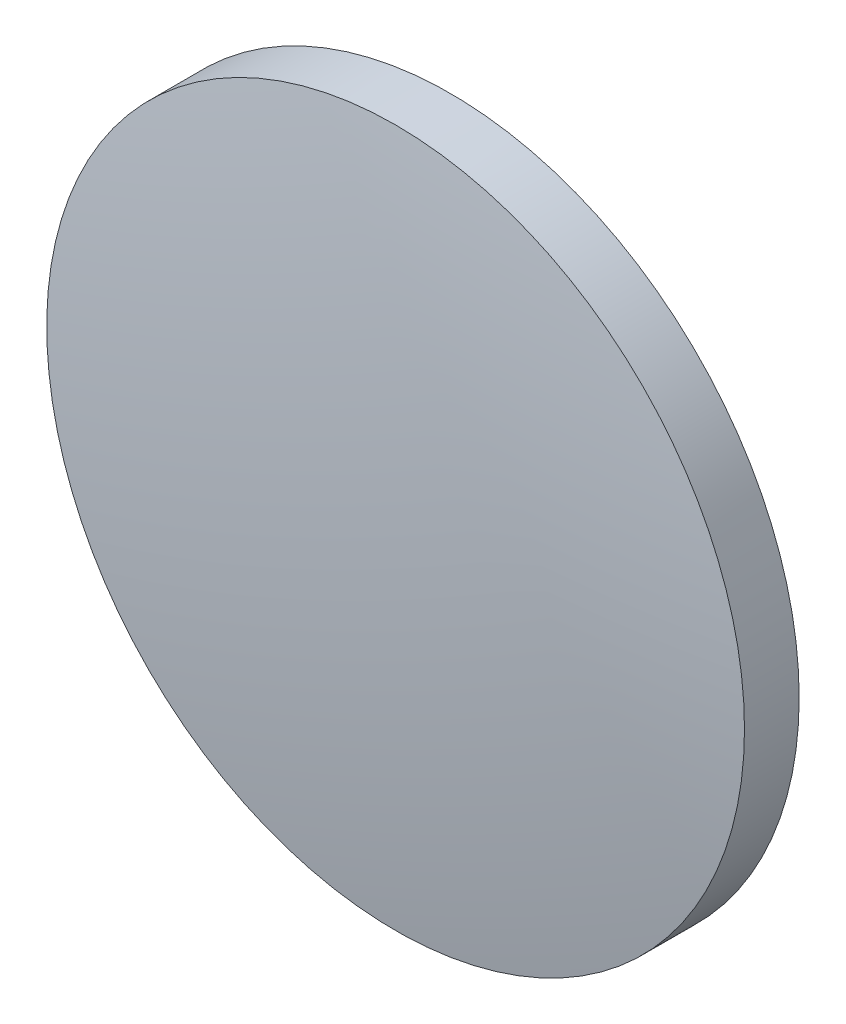
ISO-10303-21;
HEADER;
FILE_DESCRIPTION(('STEP AP214'),'2;1');
FILE_NAME('part.step','',(''),(''),'','','');
FILE_SCHEMA(('AUTOMOTIVE_DESIGN { 1 0 10303 214 1 1 1 1 }'));
ENDSEC;
DATA;
#1=APPLICATION_CONTEXT('core data for automotive mechanical design processes');
#2=APPLICATION_PROTOCOL_DEFINITION('international standard','automotive_design',2000,#1);
#3=PRODUCT_CONTEXT('',#1,'mechanical');
#4=PRODUCT('Part','Part','',(#3));
#5=PRODUCT_RELATED_PRODUCT_CATEGORY('part','',(#4));
#6=PRODUCT_DEFINITION_FORMATION('','',#4);
#7=PRODUCT_DEFINITION_CONTEXT('part definition',#1,'design');
#8=PRODUCT_DEFINITION('design','',#6,#7);
#9=PRODUCT_DEFINITION_SHAPE('','',#8);
#10=(LENGTH_UNIT() NAMED_UNIT(*) SI_UNIT(.MILLI.,.METRE.));
#11=(NAMED_UNIT(*) PLANE_ANGLE_UNIT() SI_UNIT($,.RADIAN.));
#12=(NAMED_UNIT(*) SI_UNIT($,.STERADIAN.) SOLID_ANGLE_UNIT());
#13=UNCERTAINTY_MEASURE_WITH_UNIT(LENGTH_MEASURE(1.E-05),#10,'distance_accuracy_value','');
#14=(GEOMETRIC_REPRESENTATION_CONTEXT(3) GLOBAL_UNCERTAINTY_ASSIGNED_CONTEXT((#13)) GLOBAL_UNIT_ASSIGNED_CONTEXT((#10,
#11,#12)) REPRESENTATION_CONTEXT('',''));
#15=CARTESIAN_POINT('',(0.,0.,0.));
#16=DIRECTION('',(0.,0.,1.));
#17=DIRECTION('',(1.,0.,0.));
#18=AXIS2_PLACEMENT_3D('',#15,#16,#17);
#19=CARTESIAN_POINT('',(0.,0.,-88.685));
#20=DIRECTION('',(0.,0.,1.));
#21=DIRECTION('',(0.,1.,0.));
#22=AXIS2_PLACEMENT_3D('',#19,#20,#21);
#23=SPHERICAL_SURFACE('',#22,90.13);
#24=CARTESIAN_POINT('',(0.,0.,0.545750865382734));
#25=DIRECTION('',(0.,0.,1.));
#26=DIRECTION('',(1.,0.,0.));
#27=AXIS2_PLACEMENT_3D('',#24,#25,#26);
#28=CIRCLE('',#27,12.7);
#29=CARTESIAN_POINT('',(12.7,0.,0.545750865382734));
#30=VERTEX_POINT('',#29);
#31=EDGE_CURVE('E8',#30,#30,#28,.T.);
#32=ORIENTED_EDGE('',*,*,#31,.T.);
#33=EDGE_LOOP('',(#32));
#34=FACE_BOUND('',#33,.T.);
#35=ADVANCED_FACE('F12',(#34),#23,.T.);
#36=CARTESIAN_POINT('',(0.,0.,4.30813204540037));
#37=DIRECTION('',(0.,0.,1.));
#38=DIRECTION('',(1.,0.,0.));
#39=AXIS2_PLACEMENT_3D('',#36,#37,#38);
#40=CYLINDRICAL_SURFACE('',#39,12.7);
#41=ORIENTED_EDGE('',*,*,#31,.F.);
#42=EDGE_LOOP('',(#41));
#43=FACE_BOUND('',#42,.T.);
#44=CARTESIAN_POINT('',(0.,0.,-1.445));
#45=DIRECTION('',(0.,0.,1.));
#46=DIRECTION('',(1.,0.,0.));
#47=AXIS2_PLACEMENT_3D('',#44,#45,#46);
#48=CIRCLE('',#47,12.7);
#49=CARTESIAN_POINT('',(12.7,0.,-1.445));
#50=VERTEX_POINT('',#49);
#51=EDGE_CURVE('E18',#50,#50,#48,.T.);
#52=ORIENTED_EDGE('',*,*,#51,.T.);
#53=EDGE_LOOP('',(#52));
#54=FACE_BOUND('',#53,.T.);
#55=ADVANCED_FACE('F24',(#43,#54),#40,.T.);
#56=CARTESIAN_POINT('',(0.,0.,-1.445));
#57=DIRECTION('',(0.,0.,1.));
#58=DIRECTION('',(1.,0.,0.));
#59=AXIS2_PLACEMENT_3D('',#56,#57,#58);
#60=PLANE('',#59);
#61=ORIENTED_EDGE('',*,*,#51,.F.);
#62=EDGE_LOOP('',(#61));
#63=FACE_BOUND('',#62,.T.);
#64=ADVANCED_FACE('F26',(#63),#60,.F.);
#65=CLOSED_SHELL('',(#35,#55,#64));
#66=MANIFOLD_SOLID_BREP('B1',#65);
#67=ADVANCED_BREP_SHAPE_REPRESENTATION('',(#18,#66),#14);
#68=SHAPE_DEFINITION_REPRESENTATION(#9,#67);
ENDSEC;
END-ISO-10303-21;
